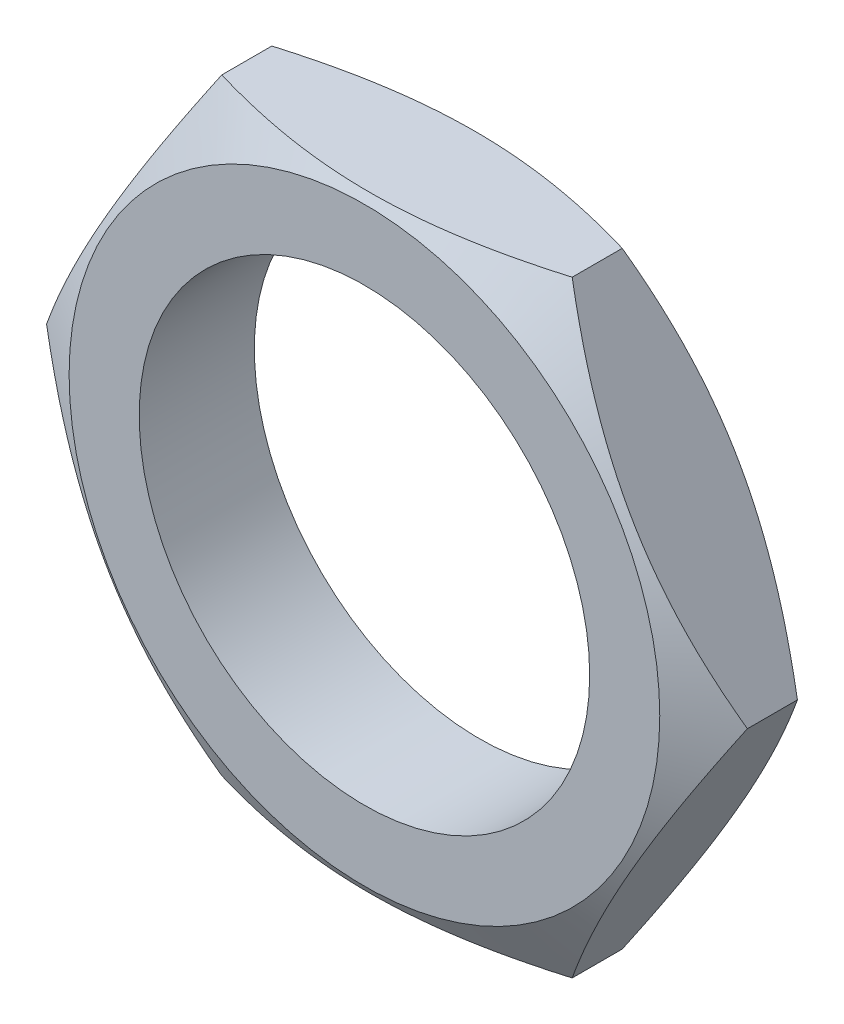
ISO-10303-21;
HEADER;
FILE_DESCRIPTION(('STEP AP214'),'2;1');
FILE_NAME('part.step','',(''),(''),'','','');
FILE_SCHEMA(('AUTOMOTIVE_DESIGN { 1 0 10303 214 1 1 1 1 }'));
ENDSEC;
DATA;
#1=APPLICATION_CONTEXT('core data for automotive mechanical design processes');
#2=APPLICATION_PROTOCOL_DEFINITION('international standard','automotive_design',2000,#1);
#3=PRODUCT_CONTEXT('',#1,'mechanical');
#4=PRODUCT('Part','Part','',(#3));
#5=PRODUCT_RELATED_PRODUCT_CATEGORY('part','',(#4));
#6=PRODUCT_DEFINITION_FORMATION('','',#4);
#7=PRODUCT_DEFINITION_CONTEXT('part definition',#1,'design');
#8=PRODUCT_DEFINITION('design','',#6,#7);
#9=PRODUCT_DEFINITION_SHAPE('','',#8);
#10=(LENGTH_UNIT() NAMED_UNIT(*) SI_UNIT(.MILLI.,.METRE.));
#11=(NAMED_UNIT(*) PLANE_ANGLE_UNIT() SI_UNIT($,.RADIAN.));
#12=(NAMED_UNIT(*) SI_UNIT($,.STERADIAN.) SOLID_ANGLE_UNIT());
#13=UNCERTAINTY_MEASURE_WITH_UNIT(LENGTH_MEASURE(1.E-05),#10,'distance_accuracy_value','');
#14=(GEOMETRIC_REPRESENTATION_CONTEXT(3) GLOBAL_UNCERTAINTY_ASSIGNED_CONTEXT((#13)) GLOBAL_UNIT_ASSIGNED_CONTEXT((#10,
#11,#12)) REPRESENTATION_CONTEXT('',''));
#15=CARTESIAN_POINT('',(0.,0.,0.));
#16=DIRECTION('',(0.,0.,1.));
#17=DIRECTION('',(1.,0.,0.));
#18=AXIS2_PLACEMENT_3D('',#15,#16,#17);
#19=CARTESIAN_POINT('',(0.,0.,0.));
#20=DIRECTION('',(0.,0.,1.));
#21=DIRECTION('',(1.,0.,0.));
#22=AXIS2_PLACEMENT_3D('',#19,#20,#21);
#23=PLANE('',#22);
#24=CARTESIAN_POINT('',(0.,0.,0.));
#25=DIRECTION('',(0.,0.,1.));
#26=DIRECTION('',(-1.,0.,0.));
#27=AXIS2_PLACEMENT_3D('',#24,#25,#26);
#28=CIRCLE('',#27,4.5);
#29=CARTESIAN_POINT('',(4.5,0.,0.));
#30=VERTEX_POINT('',#29);
#31=EDGE_CURVE('E29',#30,#30,#28,.T.);
#32=ORIENTED_EDGE('',*,*,#31,.T.);
#33=EDGE_LOOP('',(#32));
#34=FACE_BOUND('',#33,.T.);
#35=CARTESIAN_POINT('',(0.,0.,0.));
#36=DIRECTION('',(0.,0.,-1.));
#37=DIRECTION('',(1.,0.,0.));
#38=AXIS2_PLACEMENT_3D('',#35,#36,#37);
#39=CIRCLE('',#38,5.9);
#40=CARTESIAN_POINT('',(5.9,0.,0.));
#41=VERTEX_POINT('',#40);
#42=EDGE_CURVE('E128',#41,#41,#39,.T.);
#43=ORIENTED_EDGE('',*,*,#42,.T.);
#44=EDGE_LOOP('',(#43));
#45=FACE_BOUND('',#44,.T.);
#46=ADVANCED_FACE('F16',(#34,#45),#23,.F.);
#47=CARTESIAN_POINT('',(0.,0.,2.3));
#48=DIRECTION('',(0.,0.,1.));
#49=DIRECTION('',(1.,0.,0.));
#50=AXIS2_PLACEMENT_3D('',#47,#48,#49);
#51=PLANE('',#50);
#52=CARTESIAN_POINT('',(0.,0.,2.3));
#53=DIRECTION('',(0.,0.,-1.));
#54=DIRECTION('',(-1.,0.,0.));
#55=AXIS2_PLACEMENT_3D('',#52,#53,#54);
#56=CIRCLE('',#55,4.5);
#57=CARTESIAN_POINT('',(4.5,0.,2.3));
#58=VERTEX_POINT('',#57);
#59=EDGE_CURVE('E158',#58,#58,#56,.T.);
#60=ORIENTED_EDGE('',*,*,#59,.T.);
#61=EDGE_LOOP('',(#60));
#62=FACE_BOUND('',#61,.T.);
#63=CARTESIAN_POINT('',(0.,0.,2.3));
#64=DIRECTION('',(0.,0.,1.));
#65=DIRECTION('',(1.,0.,0.));
#66=AXIS2_PLACEMENT_3D('',#63,#64,#65);
#67=CIRCLE('',#66,5.9);
#68=CARTESIAN_POINT('',(5.9,0.,2.3));
#69=VERTEX_POINT('',#68);
#70=EDGE_CURVE('E150',#69,#69,#67,.T.);
#71=ORIENTED_EDGE('',*,*,#70,.T.);
#72=EDGE_LOOP('',(#71));
#73=FACE_BOUND('',#72,.T.);
#74=ADVANCED_FACE('F18',(#62,#73),#51,.T.);
#75=CARTESIAN_POINT('',(3.5,-6.06217782649107,0.));
#76=DIRECTION('',(0.,-1.,0.));
#77=DIRECTION('',(0.,0.,-1.));
#78=AXIS2_PLACEMENT_3D('',#75,#76,#77);
#79=PLANE('',#78);
#80=CARTESIAN_POINT('',(3.5,-6.06217782649108,1.65));
#81=CARTESIAN_POINT('',(0.,-6.06217782649108,2.6840909090909));
#82=CARTESIAN_POINT('',(-3.5,-6.06217782649108,1.65));
#83=(BOUNDED_CURVE() B_SPLINE_CURVE(2,(#80,#81,#82),.UNSPECIFIED.,.F.,
.F.) B_SPLINE_CURVE_WITH_KNOTS((3,3),(0.,0.708720023198736),
.UNSPECIFIED.) CURVE() GEOMETRIC_REPRESENTATION_ITEM() RATIONAL_B_SPLINE_CURVE((1.,
1.15470053837925,1.)) REPRESENTATION_ITEM(''));
#84=CARTESIAN_POINT('',(3.5,-6.06217782649107,1.65));
#85=VERTEX_POINT('',#84);
#86=CARTESIAN_POINT('',(-3.5,-6.06217782649108,1.65));
#87=VERTEX_POINT('',#86);
#88=EDGE_CURVE('E165',#85,#87,#83,.T.);
#89=ORIENTED_EDGE('',*,*,#88,.T.);
#90=DIRECTION('',(0.,0.,1.));
#91=VECTOR('',#90,1.);
#92=CARTESIAN_POINT('',(-3.5,-6.06217782649108,0.65));
#93=LINE('',#92,#91);
#94=CARTESIAN_POINT('',(-3.5,-6.06217782649108,0.65));
#95=VERTEX_POINT('',#94);
#96=EDGE_CURVE('E100',#95,#87,#93,.T.);
#97=ORIENTED_EDGE('',*,*,#96,.F.);
#98=CARTESIAN_POINT('',(-3.5,-6.06217782649108,0.65));
#99=CARTESIAN_POINT('',(0.,-6.06217782649108,-0.384090909090902));
#100=CARTESIAN_POINT('',(3.5,-6.06217782649108,0.65));
#101=(BOUNDED_CURVE() B_SPLINE_CURVE(2,(#98,#99,#100),.UNSPECIFIED.,.F.,
.F.) B_SPLINE_CURVE_WITH_KNOTS((3,3),(0.,0.708720023198736),
.UNSPECIFIED.) CURVE() GEOMETRIC_REPRESENTATION_ITEM() RATIONAL_B_SPLINE_CURVE((1.,
1.15470053837925,1.)) REPRESENTATION_ITEM(''));
#102=CARTESIAN_POINT('',(3.5,-6.06217782649107,0.65));
#103=VERTEX_POINT('',#102);
#104=EDGE_CURVE('E145',#95,#103,#101,.T.);
#105=ORIENTED_EDGE('',*,*,#104,.T.);
#106=DIRECTION('',(0.,0.,1.));
#107=VECTOR('',#106,1.);
#108=CARTESIAN_POINT('',(3.5,-6.06217782649107,0.65));
#109=LINE('',#108,#107);
#110=EDGE_CURVE('E11',#103,#85,#109,.T.);
#111=ORIENTED_EDGE('',*,*,#110,.T.);
#112=EDGE_LOOP('',(#89,#97,#105,#111));
#113=FACE_BOUND('',#112,.T.);
#114=ADVANCED_FACE('F264',(#113),#79,.T.);
#115=CARTESIAN_POINT('',(7.,0.,0.));
#116=DIRECTION('',(0.866025403784439,-0.5,0.));
#117=DIRECTION('',(0.,0.,-1.));
#118=AXIS2_PLACEMENT_3D('',#115,#116,#117);
#119=PLANE('',#118);
#120=CARTESIAN_POINT('',(7.,0.,1.65));
#121=CARTESIAN_POINT('',(5.25000000000001,-3.03108891324554,2.68409090909091));
#122=CARTESIAN_POINT('',(3.5,-6.06217782649106,1.65));
#123=(BOUNDED_CURVE() B_SPLINE_CURVE(2,(#120,#121,#122),.UNSPECIFIED.,.F.,
.F.) B_SPLINE_CURVE_WITH_KNOTS((3,3),(0.,0.708720023198737),
.UNSPECIFIED.) CURVE() GEOMETRIC_REPRESENTATION_ITEM() RATIONAL_B_SPLINE_CURVE((1.,
1.15470053837925,1.)) REPRESENTATION_ITEM(''));
#124=CARTESIAN_POINT('',(7.,0.,1.65));
#125=VERTEX_POINT('',#124);
#126=EDGE_CURVE('E201',#125,#85,#123,.T.);
#127=ORIENTED_EDGE('',*,*,#126,.T.);
#128=ORIENTED_EDGE('',*,*,#110,.F.);
#129=CARTESIAN_POINT('',(3.5,-6.06217782649107,0.65));
#130=CARTESIAN_POINT('',(5.25,-3.03108891324554,-0.384090909090908));
#131=CARTESIAN_POINT('',(7.,0.,0.65));
#132=(BOUNDED_CURVE() B_SPLINE_CURVE(2,(#129,#130,#131),.UNSPECIFIED.,.F.,
.F.) B_SPLINE_CURVE_WITH_KNOTS((3,3),(0.,0.708720023198738),
.UNSPECIFIED.) CURVE() GEOMETRIC_REPRESENTATION_ITEM() RATIONAL_B_SPLINE_CURVE((1.,
1.15470053837925,1.)) REPRESENTATION_ITEM(''));
#133=CARTESIAN_POINT('',(7.,0.,0.65));
#134=VERTEX_POINT('',#133);
#135=EDGE_CURVE('E182',#103,#134,#132,.T.);
#136=ORIENTED_EDGE('',*,*,#135,.T.);
#137=DIRECTION('',(0.,0.,1.));
#138=VECTOR('',#137,1.);
#139=CARTESIAN_POINT('',(7.,0.,0.65));
#140=LINE('',#139,#138);
#141=EDGE_CURVE('E74',#134,#125,#140,.T.);
#142=ORIENTED_EDGE('',*,*,#141,.T.);
#143=EDGE_LOOP('',(#127,#128,#136,#142));
#144=FACE_BOUND('',#143,.T.);
#145=ADVANCED_FACE('F275',(#144),#119,.T.);
#146=CARTESIAN_POINT('',(0.,0.,0.));
#147=DIRECTION('',(0.,0.,1.));
#148=DIRECTION('',(-1.,0.,0.));
#149=AXIS2_PLACEMENT_3D('',#146,#147,#148);
#150=CYLINDRICAL_SURFACE('',#149,4.5);
#151=ORIENTED_EDGE('',*,*,#31,.F.);
#152=EDGE_LOOP('',(#151));
#153=FACE_BOUND('',#152,.T.);
#154=ORIENTED_EDGE('',*,*,#59,.F.);
#155=EDGE_LOOP('',(#154));
#156=FACE_BOUND('',#155,.T.);
#157=ADVANCED_FACE('F272',(#153,#156),#150,.F.);
#158=CARTESIAN_POINT('',(3.5,6.06217782649107,0.));
#159=DIRECTION('',(0.866025403784439,0.5,0.));
#160=DIRECTION('',(0.,0.,-1.));
#161=AXIS2_PLACEMENT_3D('',#158,#159,#160);
#162=PLANE('',#161);
#163=CARTESIAN_POINT('',(3.5,6.06217782649107,1.65));
#164=CARTESIAN_POINT('',(5.25000000000001,3.03108891324554,2.68409090909091));
#165=CARTESIAN_POINT('',(7.,0.,1.65));
#166=(BOUNDED_CURVE() B_SPLINE_CURVE(2,(#163,#164,#165),.UNSPECIFIED.,.F.,
.F.) B_SPLINE_CURVE_WITH_KNOTS((3,3),(0.,0.708720023198738),
.UNSPECIFIED.) CURVE() GEOMETRIC_REPRESENTATION_ITEM() RATIONAL_B_SPLINE_CURVE((1.,
1.15470053837925,1.)) REPRESENTATION_ITEM(''));
#167=CARTESIAN_POINT('',(3.5,6.06217782649106,1.65));
#168=VERTEX_POINT('',#167);
#169=EDGE_CURVE('E164',#168,#125,#166,.T.);
#170=ORIENTED_EDGE('',*,*,#169,.T.);
#171=ORIENTED_EDGE('',*,*,#141,.F.);
#172=CARTESIAN_POINT('',(7.,0.,0.65));
#173=CARTESIAN_POINT('',(5.25000000000001,3.03108891324553,-0.384090909090908));
#174=CARTESIAN_POINT('',(3.5,6.06217782649107,0.65));
#175=(BOUNDED_CURVE() B_SPLINE_CURVE(2,(#172,#173,#174),.UNSPECIFIED.,.F.,
.F.) B_SPLINE_CURVE_WITH_KNOTS((3,3),(0.,0.708720023198738),
.UNSPECIFIED.) CURVE() GEOMETRIC_REPRESENTATION_ITEM() RATIONAL_B_SPLINE_CURVE((1.,
1.15470053837925,1.)) REPRESENTATION_ITEM(''));
#176=CARTESIAN_POINT('',(3.5,6.06217782649106,0.65));
#177=VERTEX_POINT('',#176);
#178=EDGE_CURVE('E20',#134,#177,#175,.T.);
#179=ORIENTED_EDGE('',*,*,#178,.T.);
#180=DIRECTION('',(0.,0.,1.));
#181=VECTOR('',#180,1.);
#182=CARTESIAN_POINT('',(3.5,6.06217782649107,0.65));
#183=LINE('',#182,#181);
#184=EDGE_CURVE('E57',#177,#168,#183,.T.);
#185=ORIENTED_EDGE('',*,*,#184,.T.);
#186=EDGE_LOOP('',(#170,#171,#179,#185));
#187=FACE_BOUND('',#186,.T.);
#188=ADVANCED_FACE('F268',(#187),#162,.T.);
#189=CARTESIAN_POINT('',(-3.5,6.06217782649107,0.));
#190=DIRECTION('',(0.,1.,0.));
#191=DIRECTION('',(1.,0.,0.));
#192=AXIS2_PLACEMENT_3D('',#189,#190,#191);
#193=PLANE('',#192);
#194=CARTESIAN_POINT('',(-3.5,6.06217782649107,1.65));
#195=CARTESIAN_POINT('',(0.,6.06217782649108,2.68409090909091));
#196=CARTESIAN_POINT('',(3.5,6.06217782649107,1.65));
#197=(BOUNDED_CURVE() B_SPLINE_CURVE(2,(#194,#195,#196),.UNSPECIFIED.,.F.,
.F.) B_SPLINE_CURVE_WITH_KNOTS((3,3),(0.,0.708720023198737),
.UNSPECIFIED.) CURVE() GEOMETRIC_REPRESENTATION_ITEM() RATIONAL_B_SPLINE_CURVE((1.,
1.15470053837925,1.)) REPRESENTATION_ITEM(''));
#198=CARTESIAN_POINT('',(-3.5,6.06217782649106,1.65));
#199=VERTEX_POINT('',#198);
#200=EDGE_CURVE('E159',#199,#168,#197,.T.);
#201=ORIENTED_EDGE('',*,*,#200,.T.);
#202=ORIENTED_EDGE('',*,*,#184,.F.);
#203=CARTESIAN_POINT('',(3.5,6.06217782649107,0.65));
#204=CARTESIAN_POINT('',(0.,6.06217782649107,-0.384090909090904));
#205=CARTESIAN_POINT('',(-3.5,6.06217782649107,0.65));
#206=(BOUNDED_CURVE() B_SPLINE_CURVE(2,(#203,#204,#205),.UNSPECIFIED.,.F.,
.F.) B_SPLINE_CURVE_WITH_KNOTS((3,3),(0.,0.708720023198737),
.UNSPECIFIED.) CURVE() GEOMETRIC_REPRESENTATION_ITEM() RATIONAL_B_SPLINE_CURVE((1.,
1.15470053837925,1.)) REPRESENTATION_ITEM(''));
#207=CARTESIAN_POINT('',(-3.5,6.06217782649106,0.65));
#208=VERTEX_POINT('',#207);
#209=EDGE_CURVE('E130',#177,#208,#206,.T.);
#210=ORIENTED_EDGE('',*,*,#209,.T.);
#211=DIRECTION('',(0.,0.,1.));
#212=VECTOR('',#211,1.);
#213=CARTESIAN_POINT('',(-3.5,6.06217782649107,0.65));
#214=LINE('',#213,#212);
#215=EDGE_CURVE('E114',#208,#199,#214,.T.);
#216=ORIENTED_EDGE('',*,*,#215,.T.);
#217=EDGE_LOOP('',(#201,#202,#210,#216));
#218=FACE_BOUND('',#217,.T.);
#219=ADVANCED_FACE('F131',(#218),#193,.T.);
#220=CARTESIAN_POINT('',(-3.5,-6.06217782649108,0.));
#221=DIRECTION('',(-0.866025403784439,-0.5,0.));
#222=DIRECTION('',(-0.5,0.866025403784439,0.));
#223=AXIS2_PLACEMENT_3D('',#220,#221,#222);
#224=PLANE('',#223);
#225=CARTESIAN_POINT('',(-3.5,-6.06217782649107,1.65));
#226=CARTESIAN_POINT('',(-5.25000000000001,-3.03108891324553,2.68409090909091));
#227=CARTESIAN_POINT('',(-7.,0.,1.65));
#228=(BOUNDED_CURVE() B_SPLINE_CURVE(2,(#225,#226,#227),.UNSPECIFIED.,.F.,
.F.) B_SPLINE_CURVE_WITH_KNOTS((3,3),(0.,0.708720023198738),
.UNSPECIFIED.) CURVE() GEOMETRIC_REPRESENTATION_ITEM() RATIONAL_B_SPLINE_CURVE((1.,
1.15470053837925,1.)) REPRESENTATION_ITEM(''));
#229=CARTESIAN_POINT('',(-7.,0.,1.65));
#230=VERTEX_POINT('',#229);
#231=EDGE_CURVE('E173',#87,#230,#228,.T.);
#232=ORIENTED_EDGE('',*,*,#231,.T.);
#233=DIRECTION('',(0.,0.,1.));
#234=VECTOR('',#233,1.);
#235=CARTESIAN_POINT('',(-7.,0.,0.65));
#236=LINE('',#235,#234);
#237=CARTESIAN_POINT('',(-7.,0.,0.65));
#238=VERTEX_POINT('',#237);
#239=EDGE_CURVE('E108',#238,#230,#236,.T.);
#240=ORIENTED_EDGE('',*,*,#239,.F.);
#241=CARTESIAN_POINT('',(-7.,0.,0.65));
#242=CARTESIAN_POINT('',(-5.25000000000001,-3.03108891324553,-0.384090909090908));
#243=CARTESIAN_POINT('',(-3.5,-6.06217782649107,0.65));
#244=(BOUNDED_CURVE() B_SPLINE_CURVE(2,(#241,#242,#243),.UNSPECIFIED.,.F.,
.F.) B_SPLINE_CURVE_WITH_KNOTS((3,3),(0.,0.708720023198738),
.UNSPECIFIED.) CURVE() GEOMETRIC_REPRESENTATION_ITEM() RATIONAL_B_SPLINE_CURVE((1.,
1.15470053837925,1.)) REPRESENTATION_ITEM(''));
#245=EDGE_CURVE('E138',#238,#95,#244,.T.);
#246=ORIENTED_EDGE('',*,*,#245,.T.);
#247=ORIENTED_EDGE('',*,*,#96,.T.);
#248=EDGE_LOOP('',(#232,#240,#246,#247));
#249=FACE_BOUND('',#248,.T.);
#250=ADVANCED_FACE('F256',(#249),#224,.T.);
#251=CARTESIAN_POINT('',(-7.,0.,0.));
#252=DIRECTION('',(-0.866025403784439,0.5,0.));
#253=DIRECTION('',(0.,0.,1.));
#254=AXIS2_PLACEMENT_3D('',#251,#252,#253);
#255=PLANE('',#254);
#256=CARTESIAN_POINT('',(-7.,0.,1.65));
#257=CARTESIAN_POINT('',(-5.25,3.03108891324553,2.68409090909091));
#258=CARTESIAN_POINT('',(-3.5,6.06217782649106,1.65));
#259=(BOUNDED_CURVE() B_SPLINE_CURVE(2,(#256,#257,#258),.UNSPECIFIED.,.F.,
.F.) B_SPLINE_CURVE_WITH_KNOTS((3,3),(0.,0.708720023198737),
.UNSPECIFIED.) CURVE() GEOMETRIC_REPRESENTATION_ITEM() RATIONAL_B_SPLINE_CURVE((1.,
1.15470053837925,1.)) REPRESENTATION_ITEM(''));
#260=EDGE_CURVE('E125',#230,#199,#259,.T.);
#261=ORIENTED_EDGE('',*,*,#260,.T.);
#262=ORIENTED_EDGE('',*,*,#215,.F.);
#263=CARTESIAN_POINT('',(-3.5,6.06217782649107,0.65));
#264=CARTESIAN_POINT('',(-5.25,3.03108891324554,-0.384090909090908));
#265=CARTESIAN_POINT('',(-7.,0.,0.65));
#266=(BOUNDED_CURVE() B_SPLINE_CURVE(2,(#263,#264,#265),.UNSPECIFIED.,.F.,
.F.) B_SPLINE_CURVE_WITH_KNOTS((3,3),(0.,0.708720023198738),
.UNSPECIFIED.) CURVE() GEOMETRIC_REPRESENTATION_ITEM() RATIONAL_B_SPLINE_CURVE((1.,
1.15470053837925,1.)) REPRESENTATION_ITEM(''));
#267=EDGE_CURVE('E122',#208,#238,#266,.T.);
#268=ORIENTED_EDGE('',*,*,#267,.T.);
#269=ORIENTED_EDGE('',*,*,#239,.T.);
#270=EDGE_LOOP('',(#261,#262,#268,#269));
#271=FACE_BOUND('',#270,.T.);
#272=ADVANCED_FACE('F120',(#271),#255,.T.);
#273=CARTESIAN_POINT('',(0.,0.,0.325));
#274=DIRECTION('',(0.,0.,1.));
#275=DIRECTION('',(1.,0.,0.));
#276=AXIS2_PLACEMENT_3D('',#273,#274,#275);
#277=CONICAL_SURFACE('',#276,6.45,1.03708813397059);
#278=ORIENTED_EDGE('',*,*,#42,.F.);
#279=EDGE_LOOP('',(#278));
#280=FACE_BOUND('',#279,.T.);
#281=ORIENTED_EDGE('',*,*,#178,.F.);
#282=ORIENTED_EDGE('',*,*,#135,.F.);
#283=ORIENTED_EDGE('',*,*,#104,.F.);
#284=ORIENTED_EDGE('',*,*,#245,.F.);
#285=ORIENTED_EDGE('',*,*,#267,.F.);
#286=ORIENTED_EDGE('',*,*,#209,.F.);
#287=EDGE_LOOP('',(#281,#282,#283,#284,#285,#286));
#288=FACE_BOUND('',#287,.T.);
#289=ADVANCED_FACE('F136',(#280,#288),#277,.T.);
#290=CARTESIAN_POINT('',(0.,0.,1.975));
#291=DIRECTION('',(0.,0.,-1.));
#292=DIRECTION('',(1.,0.,0.));
#293=AXIS2_PLACEMENT_3D('',#290,#291,#292);
#294=CONICAL_SURFACE('',#293,6.45,1.03708813397059);
#295=ORIENTED_EDGE('',*,*,#70,.F.);
#296=EDGE_LOOP('',(#295));
#297=FACE_BOUND('',#296,.T.);
#298=ORIENTED_EDGE('',*,*,#126,.F.);
#299=ORIENTED_EDGE('',*,*,#169,.F.);
#300=ORIENTED_EDGE('',*,*,#200,.F.);
#301=ORIENTED_EDGE('',*,*,#260,.F.);
#302=ORIENTED_EDGE('',*,*,#231,.F.);
#303=ORIENTED_EDGE('',*,*,#88,.F.);
#304=EDGE_LOOP('',(#298,#299,#300,#301,#302,#303));
#305=FACE_BOUND('',#304,.T.);
#306=ADVANCED_FACE('F247',(#297,#305),#294,.T.);
#307=CLOSED_SHELL('',(#46,#74,#114,#145,#157,#188,#219,#250,#272,#289,#306));
#308=MANIFOLD_SOLID_BREP('B1',#307);
#309=ADVANCED_BREP_SHAPE_REPRESENTATION('',(#18,#308),#14);
#310=SHAPE_DEFINITION_REPRESENTATION(#9,#309);
ENDSEC;
END-ISO-10303-21;
